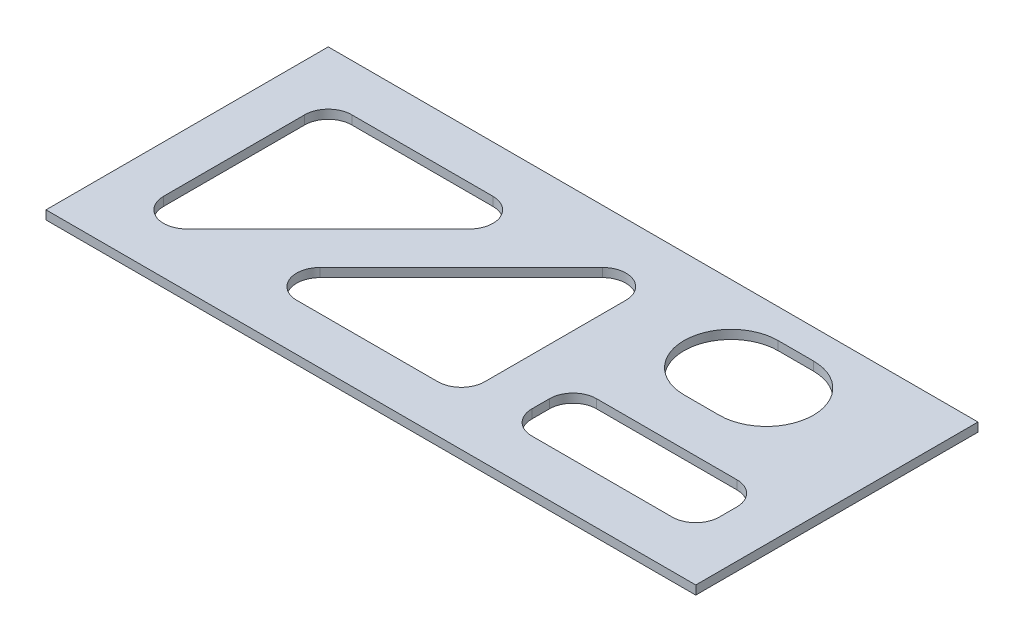
ISO-10303-21;
HEADER;
FILE_DESCRIPTION(('STEP AP214'),'2;1');
FILE_NAME('part.step','',(''),(''),'','','');
FILE_SCHEMA(('AUTOMOTIVE_DESIGN { 1 0 10303 214 1 1 1 1 }'));
ENDSEC;
DATA;
#1=APPLICATION_CONTEXT('core data for automotive mechanical design processes');
#2=APPLICATION_PROTOCOL_DEFINITION('international standard','automotive_design',2000,#1);
#3=PRODUCT_CONTEXT('',#1,'mechanical');
#4=PRODUCT('Part','Part','',(#3));
#5=PRODUCT_RELATED_PRODUCT_CATEGORY('part','',(#4));
#6=PRODUCT_DEFINITION_FORMATION('','',#4);
#7=PRODUCT_DEFINITION_CONTEXT('part definition',#1,'design');
#8=PRODUCT_DEFINITION('design','',#6,#7);
#9=PRODUCT_DEFINITION_SHAPE('','',#8);
#10=(LENGTH_UNIT() NAMED_UNIT(*) SI_UNIT(.MILLI.,.METRE.));
#11=(NAMED_UNIT(*) PLANE_ANGLE_UNIT() SI_UNIT($,.RADIAN.));
#12=(NAMED_UNIT(*) SI_UNIT($,.STERADIAN.) SOLID_ANGLE_UNIT());
#13=UNCERTAINTY_MEASURE_WITH_UNIT(LENGTH_MEASURE(1.E-05),#10,'distance_accuracy_value','');
#14=(GEOMETRIC_REPRESENTATION_CONTEXT(3) GLOBAL_UNCERTAINTY_ASSIGNED_CONTEXT((#13)) GLOBAL_UNIT_ASSIGNED_CONTEXT((#10,
#11,#12)) REPRESENTATION_CONTEXT('',''));
#15=CARTESIAN_POINT('',(0.,0.,0.));
#16=DIRECTION('',(0.,0.,1.));
#17=DIRECTION('',(1.,0.,0.));
#18=AXIS2_PLACEMENT_3D('',#15,#16,#17);
#19=CARTESIAN_POINT('',(-175.41875,2.38125,-76.2));
#20=DIRECTION('',(1.,0.,0.));
#21=DIRECTION('',(0.,0.,-1.));
#22=AXIS2_PLACEMENT_3D('',#19,#20,#21);
#23=PLANE('',#22);
#24=DIRECTION('',(0.,0.,1.));
#25=VECTOR('',#24,1.);
#26=CARTESIAN_POINT('',(-175.41875,-2.38125,-76.2));
#27=LINE('',#26,#25);
#28=CARTESIAN_POINT('',(-175.41875,-2.38125,-76.2));
#29=VERTEX_POINT('',#28);
#30=CARTESIAN_POINT('',(-175.41875,-2.38125,76.2));
#31=VERTEX_POINT('',#30);
#32=EDGE_CURVE('E506',#29,#31,#27,.T.);
#33=ORIENTED_EDGE('',*,*,#32,.T.);
#34=DIRECTION('',(0.,-1.,0.));
#35=VECTOR('',#34,1.);
#36=CARTESIAN_POINT('',(-175.41875,2.38125,76.2));
#37=LINE('',#36,#35);
#38=CARTESIAN_POINT('',(-175.41875,2.38125,76.2));
#39=VERTEX_POINT('',#38);
#40=EDGE_CURVE('E11',#39,#31,#37,.T.);
#41=ORIENTED_EDGE('',*,*,#40,.F.);
#42=DIRECTION('',(0.,0.,1.));
#43=VECTOR('',#42,1.);
#44=CARTESIAN_POINT('',(-175.41875,2.38125,-76.2));
#45=LINE('',#44,#43);
#46=CARTESIAN_POINT('',(-175.41875,2.38125,-76.2));
#47=VERTEX_POINT('',#46);
#48=EDGE_CURVE('E515',#47,#39,#45,.T.);
#49=ORIENTED_EDGE('',*,*,#48,.F.);
#50=DIRECTION('',(0.,-1.,0.));
#51=VECTOR('',#50,1.);
#52=CARTESIAN_POINT('',(-175.41875,2.38125,-76.2));
#53=LINE('',#52,#51);
#54=EDGE_CURVE('E529',#47,#29,#53,.T.);
#55=ORIENTED_EDGE('',*,*,#54,.T.);
#56=EDGE_LOOP('',(#33,#41,#49,#55));
#57=FACE_BOUND('',#56,.T.);
#58=ADVANCED_FACE('F38',(#57),#23,.F.);
#59=CARTESIAN_POINT('',(175.41875,2.38125,76.2));
#60=DIRECTION('',(0.,0.,-1.));
#61=DIRECTION('',(-1.,0.,0.));
#62=AXIS2_PLACEMENT_3D('',#59,#60,#61);
#63=PLANE('',#62);
#64=DIRECTION('',(1.,0.,0.));
#65=VECTOR('',#64,1.);
#66=CARTESIAN_POINT('',(175.41875,-2.38125,76.2));
#67=LINE('',#66,#65);
#68=CARTESIAN_POINT('',(175.41875,-2.38125,76.2));
#69=VERTEX_POINT('',#68);
#70=EDGE_CURVE('E533',#31,#69,#67,.T.);
#71=ORIENTED_EDGE('',*,*,#70,.T.);
#72=DIRECTION('',(0.,-1.,0.));
#73=VECTOR('',#72,1.);
#74=CARTESIAN_POINT('',(175.41875,2.38125,76.2));
#75=LINE('',#74,#73);
#76=CARTESIAN_POINT('',(175.41875,2.38125,76.2));
#77=VERTEX_POINT('',#76);
#78=EDGE_CURVE('E46',#77,#69,#75,.T.);
#79=ORIENTED_EDGE('',*,*,#78,.F.);
#80=DIRECTION('',(1.,0.,0.));
#81=VECTOR('',#80,1.);
#82=CARTESIAN_POINT('',(175.41875,2.38125,76.2));
#83=LINE('',#82,#81);
#84=EDGE_CURVE('E519',#39,#77,#83,.T.);
#85=ORIENTED_EDGE('',*,*,#84,.F.);
#86=ORIENTED_EDGE('',*,*,#40,.T.);
#87=EDGE_LOOP('',(#71,#79,#85,#86));
#88=FACE_BOUND('',#87,.T.);
#89=ADVANCED_FACE('F566',(#88),#63,.F.);
#90=CARTESIAN_POINT('',(175.41875,2.38125,-76.2));
#91=DIRECTION('',(-1.,0.,0.));
#92=DIRECTION('',(0.,0.,1.));
#93=AXIS2_PLACEMENT_3D('',#90,#91,#92);
#94=PLANE('',#93);
#95=DIRECTION('',(0.,0.,-1.));
#96=VECTOR('',#95,1.);
#97=CARTESIAN_POINT('',(175.41875,-2.38125,-76.2));
#98=LINE('',#97,#96);
#99=CARTESIAN_POINT('',(175.41875,-2.38125,-76.2));
#100=VERTEX_POINT('',#99);
#101=EDGE_CURVE('E536',#69,#100,#98,.T.);
#102=ORIENTED_EDGE('',*,*,#101,.T.);
#103=DIRECTION('',(0.,-1.,0.));
#104=VECTOR('',#103,1.);
#105=CARTESIAN_POINT('',(175.41875,2.38125,-76.2));
#106=LINE('',#105,#104);
#107=CARTESIAN_POINT('',(175.41875,2.38125,-76.2));
#108=VERTEX_POINT('',#107);
#109=EDGE_CURVE('E544',#108,#100,#106,.T.);
#110=ORIENTED_EDGE('',*,*,#109,.F.);
#111=DIRECTION('',(0.,0.,-1.));
#112=VECTOR('',#111,1.);
#113=CARTESIAN_POINT('',(175.41875,2.38125,-76.2));
#114=LINE('',#113,#112);
#115=EDGE_CURVE('E523',#77,#108,#114,.T.);
#116=ORIENTED_EDGE('',*,*,#115,.F.);
#117=ORIENTED_EDGE('',*,*,#78,.T.);
#118=EDGE_LOOP('',(#102,#110,#116,#117));
#119=FACE_BOUND('',#118,.T.);
#120=ADVANCED_FACE('F551',(#119),#94,.F.);
#121=CARTESIAN_POINT('',(175.41875,2.38125,-76.2));
#122=DIRECTION('',(0.,0.,1.));
#123=DIRECTION('',(1.,0.,0.));
#124=AXIS2_PLACEMENT_3D('',#121,#122,#123);
#125=PLANE('',#124);
#126=DIRECTION('',(-1.,0.,0.));
#127=VECTOR('',#126,1.);
#128=CARTESIAN_POINT('',(175.41875,-2.38125,-76.2));
#129=LINE('',#128,#127);
#130=EDGE_CURVE('E520',#100,#29,#129,.T.);
#131=ORIENTED_EDGE('',*,*,#130,.T.);
#132=ORIENTED_EDGE('',*,*,#54,.F.);
#133=DIRECTION('',(-1.,0.,0.));
#134=VECTOR('',#133,1.);
#135=CARTESIAN_POINT('',(175.41875,2.38125,-76.2));
#136=LINE('',#135,#134);
#137=EDGE_CURVE('E526',#108,#47,#136,.T.);
#138=ORIENTED_EDGE('',*,*,#137,.F.);
#139=ORIENTED_EDGE('',*,*,#109,.T.);
#140=EDGE_LOOP('',(#131,#132,#138,#139));
#141=FACE_BOUND('',#140,.T.);
#142=ADVANCED_FACE('F559',(#141),#125,.F.);
#143=CARTESIAN_POINT('',(-175.41875,2.38125,76.2));
#144=DIRECTION('',(0.,-1.,0.));
#145=DIRECTION('',(0.,0.,-1.));
#146=AXIS2_PLACEMENT_3D('',#143,#144,#145);
#147=PLANE('',#146);
#148=DIRECTION('',(1.,0.,0.));
#149=VECTOR('',#148,1.);
#150=CARTESIAN_POINT('',(61.523298968552,2.38125,50.8));
#151=LINE('',#150,#149);
#152=CARTESIAN_POINT('',(61.523298968552,2.38125,50.8));
#153=VERTEX_POINT('',#152);
#154=CARTESIAN_POINT('',(137.31875,2.38125,50.8));
#155=VERTEX_POINT('',#154);
#156=EDGE_CURVE('E308',#153,#155,#151,.T.);
#157=ORIENTED_EDGE('',*,*,#156,.F.);
#158=CARTESIAN_POINT('',(61.523298968552,2.38125,38.1));
#159=DIRECTION('',(0.,1.,0.));
#160=DIRECTION('',(0.,0.,1.));
#161=AXIS2_PLACEMENT_3D('',#158,#159,#160);
#162=CIRCLE('',#161,12.7);
#163=CARTESIAN_POINT('',(48.823298968552,2.38125,38.1));
#164=VERTEX_POINT('',#163);
#165=EDGE_CURVE('E56',#164,#153,#162,.T.);
#166=ORIENTED_EDGE('',*,*,#165,.F.);
#167=DIRECTION('',(0.,0.,1.));
#168=VECTOR('',#167,1.);
#169=CARTESIAN_POINT('',(48.8232989685521,2.38125,28.5749999999999));
#170=LINE('',#169,#168);
#171=CARTESIAN_POINT('',(48.8232989685521,2.38125,28.5749999999999));
#172=VERTEX_POINT('',#171);
#173=EDGE_CURVE('E283',#172,#164,#170,.T.);
#174=ORIENTED_EDGE('',*,*,#173,.F.);
#175=CARTESIAN_POINT('',(61.5232989685521,2.38125,28.5749999999999));
#176=DIRECTION('',(0.,1.,0.));
#177=DIRECTION('',(0.,0.,1.));
#178=AXIS2_PLACEMENT_3D('',#175,#176,#177);
#179=CIRCLE('',#178,12.7);
#180=CARTESIAN_POINT('',(61.5232989685521,2.38125,15.8749999999999));
#181=VERTEX_POINT('',#180);
#182=EDGE_CURVE('E288',#181,#172,#179,.T.);
#183=ORIENTED_EDGE('',*,*,#182,.F.);
#184=DIRECTION('',(-1.,0.,0.));
#185=VECTOR('',#184,1.);
#186=CARTESIAN_POINT('',(137.31875,2.38125,15.8749999999999));
#187=LINE('',#186,#185);
#188=CARTESIAN_POINT('',(137.31875,2.38125,15.875));
#189=VERTEX_POINT('',#188);
#190=EDGE_CURVE('E320',#189,#181,#187,.T.);
#191=ORIENTED_EDGE('',*,*,#190,.F.);
#192=CARTESIAN_POINT('',(137.31875,2.38125,28.5749999999999));
#193=DIRECTION('',(0.,1.,0.));
#194=DIRECTION('',(0.,0.,1.));
#195=AXIS2_PLACEMENT_3D('',#192,#193,#194);
#196=CIRCLE('',#195,12.7);
#197=CARTESIAN_POINT('',(150.01875,2.38125,28.5749999999999));
#198=VERTEX_POINT('',#197);
#199=EDGE_CURVE('E317',#198,#189,#196,.T.);
#200=ORIENTED_EDGE('',*,*,#199,.F.);
#201=DIRECTION('',(0.,0.,-1.));
#202=VECTOR('',#201,1.);
#203=CARTESIAN_POINT('',(150.01875,2.38125,38.1));
#204=LINE('',#203,#202);
#205=CARTESIAN_POINT('',(150.01875,2.38125,38.1));
#206=VERTEX_POINT('',#205);
#207=EDGE_CURVE('E314',#206,#198,#204,.T.);
#208=ORIENTED_EDGE('',*,*,#207,.F.);
#209=CARTESIAN_POINT('',(137.31875,2.38125,38.1));
#210=DIRECTION('',(0.,1.,0.));
#211=DIRECTION('',(0.,0.,1.));
#212=AXIS2_PLACEMENT_3D('',#209,#210,#211);
#213=CIRCLE('',#212,12.7);
#214=EDGE_CURVE('E311',#155,#206,#213,.T.);
#215=ORIENTED_EDGE('',*,*,#214,.F.);
#216=EDGE_LOOP('',(#157,#166,#174,#183,#191,#200,#208,#215));
#217=FACE_BOUND('',#216,.T.);
#218=DIRECTION('',(0.,0.,-1.));
#219=VECTOR('',#218,1.);
#220=CARTESIAN_POINT('',(23.4232989685521,2.38125,38.1));
#221=LINE('',#220,#219);
#222=CARTESIAN_POINT('',(23.4232989685521,2.38125,38.1));
#223=VERTEX_POINT('',#222);
#224=CARTESIAN_POINT('',(23.4232989685521,2.38125,-38.1000000000001));
#225=VERTEX_POINT('',#224);
#226=EDGE_CURVE('E372',#223,#225,#221,.T.);
#227=ORIENTED_EDGE('',*,*,#226,.F.);
#228=CARTESIAN_POINT('',(10.7232989685521,2.38125,38.1));
#229=DIRECTION('',(0.,1.,0.));
#230=DIRECTION('',(0.,0.,1.));
#231=AXIS2_PLACEMENT_3D('',#228,#229,#230);
#232=CIRCLE('',#231,12.7);
#233=CARTESIAN_POINT('',(10.7232989685521,2.38125,50.8));
#234=VERTEX_POINT('',#233);
#235=EDGE_CURVE('E330',#234,#223,#232,.T.);
#236=ORIENTED_EDGE('',*,*,#235,.F.);
#237=DIRECTION('',(1.,0.,0.));
#238=VECTOR('',#237,1.);
#239=CARTESIAN_POINT('',(-65.4767010314471,2.38125,50.8));
#240=LINE('',#239,#238);
#241=CARTESIAN_POINT('',(-65.4767010314471,2.38125,50.8));
#242=VERTEX_POINT('',#241);
#243=EDGE_CURVE('E349',#242,#234,#240,.T.);
#244=ORIENTED_EDGE('',*,*,#243,.F.);
#245=CARTESIAN_POINT('',(-65.4767010314471,2.38125,38.1));
#246=DIRECTION('',(0.,1.,0.));
#247=DIRECTION('',(0.,0.,1.));
#248=AXIS2_PLACEMENT_3D('',#245,#246,#247);
#249=CIRCLE('',#248,12.7);
#250=CARTESIAN_POINT('',(-74.4569571525163,2.38125,29.1197438789309));
#251=VERTEX_POINT('',#250);
#252=EDGE_CURVE('E384',#251,#242,#249,.T.);
#253=ORIENTED_EDGE('',*,*,#252,.F.);
#254=DIRECTION('',(-0.707106781186544,0.,0.707106781186552));
#255=VECTOR('',#254,1.);
#256=CARTESIAN_POINT('',(1.74304284748289,2.38125,-47.0802561210692));
#257=LINE('',#256,#255);
#258=CARTESIAN_POINT('',(1.74304284748287,2.38125,-47.0802561210692));
#259=VERTEX_POINT('',#258);
#260=EDGE_CURVE('E380',#259,#251,#257,.T.);
#261=ORIENTED_EDGE('',*,*,#260,.F.);
#262=CARTESIAN_POINT('',(10.7232989685521,2.38125,-38.1000000000001));
#263=DIRECTION('',(0.,1.,0.));
#264=DIRECTION('',(0.,0.,1.));
#265=AXIS2_PLACEMENT_3D('',#262,#263,#264);
#266=CIRCLE('',#265,12.7);
#267=EDGE_CURVE('E376',#225,#259,#266,.T.);
#268=ORIENTED_EDGE('',*,*,#267,.F.);
#269=EDGE_LOOP('',(#227,#236,#244,#253,#261,#268));
#270=FACE_BOUND('',#269,.T.);
#271=DIRECTION('',(0.,0.,1.));
#272=VECTOR('',#271,1.);
#273=CARTESIAN_POINT('',(-150.01875,2.38125,38.1));
#274=LINE('',#273,#272);
#275=CARTESIAN_POINT('',(-150.01875,2.38125,-38.1000000000001));
#276=VERTEX_POINT('',#275);
#277=CARTESIAN_POINT('',(-150.01875,2.38125,38.1));
#278=VERTEX_POINT('',#277);
#279=EDGE_CURVE('E438',#276,#278,#274,.T.);
#280=ORIENTED_EDGE('',*,*,#279,.F.);
#281=CARTESIAN_POINT('',(-137.31875,2.38125,-38.1000000000001));
#282=DIRECTION('',(0.,1.,0.));
#283=DIRECTION('',(0.,0.,-1.));
#284=AXIS2_PLACEMENT_3D('',#281,#282,#283);
#285=CIRCLE('',#284,12.7);
#286=CARTESIAN_POINT('',(-137.31875,2.38125,-50.8));
#287=VERTEX_POINT('',#286);
#288=EDGE_CURVE('E394',#287,#276,#285,.T.);
#289=ORIENTED_EDGE('',*,*,#288,.F.);
#290=DIRECTION('',(-1.,0.,0.));
#291=VECTOR('',#290,1.);
#292=CARTESIAN_POINT('',(-137.31875,2.38125,-50.8));
#293=LINE('',#292,#291);
#294=CARTESIAN_POINT('',(-61.1187500000008,2.38125,-50.8));
#295=VERTEX_POINT('',#294);
#296=EDGE_CURVE('E415',#295,#287,#293,.T.);
#297=ORIENTED_EDGE('',*,*,#296,.F.);
#298=CARTESIAN_POINT('',(-61.1187500000008,2.38125,-38.1000000000001));
#299=DIRECTION('',(0.,1.,0.));
#300=DIRECTION('',(0.,0.,-1.));
#301=AXIS2_PLACEMENT_3D('',#298,#299,#300);
#302=CIRCLE('',#301,12.7);
#303=CARTESIAN_POINT('',(-52.1384938789315,2.38125,-29.119743878931));
#304=VERTEX_POINT('',#303);
#305=EDGE_CURVE('E450',#304,#295,#302,.T.);
#306=ORIENTED_EDGE('',*,*,#305,.F.);
#307=DIRECTION('',(0.707106781186544,0.,-0.707106781186551));
#308=VECTOR('',#307,1.);
#309=CARTESIAN_POINT('',(-52.1384938789315,2.38125,-29.1197438789309));
#310=LINE('',#309,#308);
#311=CARTESIAN_POINT('',(-128.338493878931,2.38125,47.0802561210691));
#312=VERTEX_POINT('',#311);
#313=EDGE_CURVE('E446',#312,#304,#310,.T.);
#314=ORIENTED_EDGE('',*,*,#313,.F.);
#315=CARTESIAN_POINT('',(-137.31875,2.38125,38.1));
#316=DIRECTION('',(0.,1.,0.));
#317=DIRECTION('',(0.,0.,-1.));
#318=AXIS2_PLACEMENT_3D('',#315,#316,#317);
#319=CIRCLE('',#318,12.7);
#320=EDGE_CURVE('E442',#278,#312,#319,.T.);
#321=ORIENTED_EDGE('',*,*,#320,.F.);
#322=EDGE_LOOP('',(#280,#289,#297,#306,#314,#321));
#323=FACE_BOUND('',#322,.T.);
#324=DIRECTION('',(-1.,0.,0.));
#325=VECTOR('',#324,1.);
#326=CARTESIAN_POINT('',(102.39375,2.38125,-60.325));
#327=LINE('',#326,#325);
#328=CARTESIAN_POINT('',(102.39375,2.38125,-60.3250000000001));
#329=VERTEX_POINT('',#328);
#330=CARTESIAN_POINT('',(83.34375,2.38125,-60.325));
#331=VERTEX_POINT('',#330);
#332=EDGE_CURVE('E494',#329,#331,#327,.T.);
#333=ORIENTED_EDGE('',*,*,#332,.F.);
#334=CARTESIAN_POINT('',(102.39375,2.38125,-34.9250000000001));
#335=DIRECTION('',(0.,1.,0.));
#336=DIRECTION('',(0.,0.,1.));
#337=AXIS2_PLACEMENT_3D('',#334,#335,#336);
#338=CIRCLE('',#337,25.4);
#339=CARTESIAN_POINT('',(102.39375,2.38125,-9.52500000000005));
#340=VERTEX_POINT('',#339);
#341=EDGE_CURVE('E460',#340,#329,#338,.T.);
#342=ORIENTED_EDGE('',*,*,#341,.F.);
#343=DIRECTION('',(1.,0.,0.));
#344=VECTOR('',#343,1.);
#345=CARTESIAN_POINT('',(102.39375,2.38125,-9.52500000000005));
#346=LINE('',#345,#344);
#347=CARTESIAN_POINT('',(83.34375,2.38125,-9.52500000000005));
#348=VERTEX_POINT('',#347);
#349=EDGE_CURVE('E480',#348,#340,#346,.T.);
#350=ORIENTED_EDGE('',*,*,#349,.F.);
#351=CARTESIAN_POINT('',(83.34375,2.38125,-34.925));
#352=DIRECTION('',(0.,1.,0.));
#353=DIRECTION('',(0.,0.,1.));
#354=AXIS2_PLACEMENT_3D('',#351,#352,#353);
#355=CIRCLE('',#354,25.4);
#356=EDGE_CURVE('E498',#331,#348,#355,.T.);
#357=ORIENTED_EDGE('',*,*,#356,.F.);
#358=EDGE_LOOP('',(#333,#342,#350,#357));
#359=FACE_BOUND('',#358,.T.);
#360=ORIENTED_EDGE('',*,*,#48,.T.);
#361=ORIENTED_EDGE('',*,*,#84,.T.);
#362=ORIENTED_EDGE('',*,*,#115,.T.);
#363=ORIENTED_EDGE('',*,*,#137,.T.);
#364=EDGE_LOOP('',(#360,#361,#362,#363));
#365=FACE_BOUND('',#364,.T.);
#366=ADVANCED_FACE('F565',(#217,#270,#323,#359,#365),#147,.F.);
#367=CARTESIAN_POINT('',(-175.41875,-2.38125,76.2));
#368=DIRECTION('',(0.,-1.,0.));
#369=DIRECTION('',(0.,0.,-1.));
#370=AXIS2_PLACEMENT_3D('',#367,#368,#369);
#371=PLANE('',#370);
#372=CARTESIAN_POINT('',(61.523298968552,-2.38125,38.1));
#373=DIRECTION('',(0.,1.,0.));
#374=DIRECTION('',(0.,0.,1.));
#375=AXIS2_PLACEMENT_3D('',#372,#373,#374);
#376=CIRCLE('',#375,12.7);
#377=CARTESIAN_POINT('',(48.823298968552,-2.38125,38.1));
#378=VERTEX_POINT('',#377);
#379=CARTESIAN_POINT('',(61.523298968552,-2.38125,50.8));
#380=VERTEX_POINT('',#379);
#381=EDGE_CURVE('E263',#378,#380,#376,.T.);
#382=ORIENTED_EDGE('',*,*,#381,.T.);
#383=DIRECTION('',(1.,0.,0.));
#384=VECTOR('',#383,1.);
#385=CARTESIAN_POINT('',(61.523298968552,-2.38125,50.8));
#386=LINE('',#385,#384);
#387=CARTESIAN_POINT('',(137.31875,-2.38125,50.8));
#388=VERTEX_POINT('',#387);
#389=EDGE_CURVE('E273',#380,#388,#386,.T.);
#390=ORIENTED_EDGE('',*,*,#389,.T.);
#391=CARTESIAN_POINT('',(137.31875,-2.38125,38.1));
#392=DIRECTION('',(0.,1.,0.));
#393=DIRECTION('',(0.,0.,1.));
#394=AXIS2_PLACEMENT_3D('',#391,#392,#393);
#395=CIRCLE('',#394,12.7);
#396=CARTESIAN_POINT('',(150.01875,-2.38125,38.1));
#397=VERTEX_POINT('',#396);
#398=EDGE_CURVE('E64',#388,#397,#395,.T.);
#399=ORIENTED_EDGE('',*,*,#398,.T.);
#400=DIRECTION('',(0.,0.,-1.));
#401=VECTOR('',#400,1.);
#402=CARTESIAN_POINT('',(150.01875,-2.38125,38.1));
#403=LINE('',#402,#401);
#404=CARTESIAN_POINT('',(150.01875,-2.38125,28.5749999999999));
#405=VERTEX_POINT('',#404);
#406=EDGE_CURVE('E292',#397,#405,#403,.T.);
#407=ORIENTED_EDGE('',*,*,#406,.T.);
#408=CARTESIAN_POINT('',(137.31875,-2.38125,28.5749999999999));
#409=DIRECTION('',(0.,1.,0.));
#410=DIRECTION('',(0.,0.,1.));
#411=AXIS2_PLACEMENT_3D('',#408,#409,#410);
#412=CIRCLE('',#411,12.7);
#413=CARTESIAN_POINT('',(137.31875,-2.38125,15.875));
#414=VERTEX_POINT('',#413);
#415=EDGE_CURVE('E295',#405,#414,#412,.T.);
#416=ORIENTED_EDGE('',*,*,#415,.T.);
#417=DIRECTION('',(-1.,0.,0.));
#418=VECTOR('',#417,1.);
#419=CARTESIAN_POINT('',(137.31875,-2.38125,15.8749999999999));
#420=LINE('',#419,#418);
#421=CARTESIAN_POINT('',(61.5232989685521,-2.38125,15.8749999999999));
#422=VERTEX_POINT('',#421);
#423=EDGE_CURVE('E298',#414,#422,#420,.T.);
#424=ORIENTED_EDGE('',*,*,#423,.T.);
#425=CARTESIAN_POINT('',(61.5232989685521,-2.38125,28.5749999999999));
#426=DIRECTION('',(0.,1.,0.));
#427=DIRECTION('',(0.,0.,1.));
#428=AXIS2_PLACEMENT_3D('',#425,#426,#427);
#429=CIRCLE('',#428,12.7);
#430=CARTESIAN_POINT('',(48.8232989685521,-2.38125,28.5749999999999));
#431=VERTEX_POINT('',#430);
#432=EDGE_CURVE('E302',#422,#431,#429,.T.);
#433=ORIENTED_EDGE('',*,*,#432,.T.);
#434=DIRECTION('',(0.,0.,1.));
#435=VECTOR('',#434,1.);
#436=CARTESIAN_POINT('',(48.8232989685521,-2.38125,28.5749999999999));
#437=LINE('',#436,#435);
#438=EDGE_CURVE('E270',#431,#378,#437,.T.);
#439=ORIENTED_EDGE('',*,*,#438,.T.);
#440=EDGE_LOOP('',(#382,#390,#399,#407,#416,#424,#433,#439));
#441=FACE_BOUND('',#440,.T.);
#442=CARTESIAN_POINT('',(10.7232989685521,-2.38125,38.1));
#443=DIRECTION('',(0.,1.,0.));
#444=DIRECTION('',(0.,0.,1.));
#445=AXIS2_PLACEMENT_3D('',#442,#443,#444);
#446=CIRCLE('',#445,12.7);
#447=CARTESIAN_POINT('',(10.7232989685521,-2.38125,50.8));
#448=VERTEX_POINT('',#447);
#449=CARTESIAN_POINT('',(23.4232989685521,-2.38125,38.1));
#450=VERTEX_POINT('',#449);
#451=EDGE_CURVE('E344',#448,#450,#446,.T.);
#452=ORIENTED_EDGE('',*,*,#451,.T.);
#453=DIRECTION('',(0.,0.,-1.));
#454=VECTOR('',#453,1.);
#455=CARTESIAN_POINT('',(23.4232989685521,-2.38125,38.1));
#456=LINE('',#455,#454);
#457=CARTESIAN_POINT('',(23.4232989685521,-2.38125,-38.1000000000001));
#458=VERTEX_POINT('',#457);
#459=EDGE_CURVE('E348',#450,#458,#456,.T.);
#460=ORIENTED_EDGE('',*,*,#459,.T.);
#461=CARTESIAN_POINT('',(10.7232989685521,-2.38125,-38.1000000000001));
#462=DIRECTION('',(0.,1.,0.));
#463=DIRECTION('',(0.,0.,1.));
#464=AXIS2_PLACEMENT_3D('',#461,#462,#463);
#465=CIRCLE('',#464,12.7);
#466=CARTESIAN_POINT('',(1.74304284748287,-2.38125,-47.0802561210692));
#467=VERTEX_POINT('',#466);
#468=EDGE_CURVE('E353',#458,#467,#465,.T.);
#469=ORIENTED_EDGE('',*,*,#468,.T.);
#470=DIRECTION('',(-0.707106781186544,0.,0.707106781186552));
#471=VECTOR('',#470,1.);
#472=CARTESIAN_POINT('',(1.74304284748289,-2.38125,-47.0802561210692));
#473=LINE('',#472,#471);
#474=CARTESIAN_POINT('',(-74.4569571525163,-2.38125,29.1197438789309));
#475=VERTEX_POINT('',#474);
#476=EDGE_CURVE('E357',#467,#475,#473,.T.);
#477=ORIENTED_EDGE('',*,*,#476,.T.);
#478=CARTESIAN_POINT('',(-65.4767010314471,-2.38125,38.1));
#479=DIRECTION('',(0.,1.,0.));
#480=DIRECTION('',(0.,0.,1.));
#481=AXIS2_PLACEMENT_3D('',#478,#479,#480);
#482=CIRCLE('',#481,12.7);
#483=CARTESIAN_POINT('',(-65.4767010314471,-2.38125,50.8));
#484=VERTEX_POINT('',#483);
#485=EDGE_CURVE('E361',#475,#484,#482,.T.);
#486=ORIENTED_EDGE('',*,*,#485,.T.);
#487=DIRECTION('',(1.,0.,0.));
#488=VECTOR('',#487,1.);
#489=CARTESIAN_POINT('',(-65.4767010314471,-2.38125,50.8));
#490=LINE('',#489,#488);
#491=EDGE_CURVE('E365',#484,#448,#490,.T.);
#492=ORIENTED_EDGE('',*,*,#491,.T.);
#493=EDGE_LOOP('',(#452,#460,#469,#477,#486,#492));
#494=FACE_BOUND('',#493,.T.);
#495=CARTESIAN_POINT('',(-137.31875,-2.38125,-38.1000000000001));
#496=DIRECTION('',(0.,1.,0.));
#497=DIRECTION('',(0.,0.,-1.));
#498=AXIS2_PLACEMENT_3D('',#495,#496,#497);
#499=CIRCLE('',#498,12.7);
#500=CARTESIAN_POINT('',(-137.31875,-2.38125,-50.8));
#501=VERTEX_POINT('',#500);
#502=CARTESIAN_POINT('',(-150.01875,-2.38125,-38.1000000000001));
#503=VERTEX_POINT('',#502);
#504=EDGE_CURVE('E410',#501,#503,#499,.T.);
#505=ORIENTED_EDGE('',*,*,#504,.T.);
#506=DIRECTION('',(0.,0.,1.));
#507=VECTOR('',#506,1.);
#508=CARTESIAN_POINT('',(-150.01875,-2.38125,38.1));
#509=LINE('',#508,#507);
#510=CARTESIAN_POINT('',(-150.01875,-2.38125,38.1));
#511=VERTEX_POINT('',#510);
#512=EDGE_CURVE('E414',#503,#511,#509,.T.);
#513=ORIENTED_EDGE('',*,*,#512,.T.);
#514=CARTESIAN_POINT('',(-137.31875,-2.38125,38.1));
#515=DIRECTION('',(0.,1.,0.));
#516=DIRECTION('',(0.,0.,-1.));
#517=AXIS2_PLACEMENT_3D('',#514,#515,#516);
#518=CIRCLE('',#517,12.7);
#519=CARTESIAN_POINT('',(-128.338493878931,-2.38125,47.0802561210691));
#520=VERTEX_POINT('',#519);
#521=EDGE_CURVE('E419',#511,#520,#518,.T.);
#522=ORIENTED_EDGE('',*,*,#521,.T.);
#523=DIRECTION('',(0.707106781186544,0.,-0.707106781186551));
#524=VECTOR('',#523,1.);
#525=CARTESIAN_POINT('',(-52.1384938789315,-2.38125,-29.1197438789309));
#526=LINE('',#525,#524);
#527=CARTESIAN_POINT('',(-52.1384938789315,-2.38125,-29.119743878931));
#528=VERTEX_POINT('',#527);
#529=EDGE_CURVE('E423',#520,#528,#526,.T.);
#530=ORIENTED_EDGE('',*,*,#529,.T.);
#531=CARTESIAN_POINT('',(-61.1187500000008,-2.38125,-38.1000000000001));
#532=DIRECTION('',(0.,1.,0.));
#533=DIRECTION('',(0.,0.,-1.));
#534=AXIS2_PLACEMENT_3D('',#531,#532,#533);
#535=CIRCLE('',#534,12.7);
#536=CARTESIAN_POINT('',(-61.1187500000008,-2.38125,-50.8));
#537=VERTEX_POINT('',#536);
#538=EDGE_CURVE('E427',#528,#537,#535,.T.);
#539=ORIENTED_EDGE('',*,*,#538,.T.);
#540=DIRECTION('',(-1.,0.,0.));
#541=VECTOR('',#540,1.);
#542=CARTESIAN_POINT('',(-137.31875,-2.38125,-50.8));
#543=LINE('',#542,#541);
#544=EDGE_CURVE('E431',#537,#501,#543,.T.);
#545=ORIENTED_EDGE('',*,*,#544,.T.);
#546=EDGE_LOOP('',(#505,#513,#522,#530,#539,#545));
#547=FACE_BOUND('',#546,.T.);
#548=CARTESIAN_POINT('',(102.39375,-2.38125,-34.9250000000001));
#549=DIRECTION('',(0.,1.,0.));
#550=DIRECTION('',(0.,0.,1.));
#551=AXIS2_PLACEMENT_3D('',#548,#549,#550);
#552=CIRCLE('',#551,25.4);
#553=CARTESIAN_POINT('',(102.39375,-2.38125,-9.52500000000005));
#554=VERTEX_POINT('',#553);
#555=CARTESIAN_POINT('',(102.39375,-2.38125,-60.325));
#556=VERTEX_POINT('',#555);
#557=EDGE_CURVE('E475',#554,#556,#552,.T.);
#558=ORIENTED_EDGE('',*,*,#557,.T.);
#559=DIRECTION('',(-1.,0.,0.));
#560=VECTOR('',#559,1.);
#561=CARTESIAN_POINT('',(102.39375,-2.38125,-60.325));
#562=LINE('',#561,#560);
#563=CARTESIAN_POINT('',(83.34375,-2.38125,-60.325));
#564=VERTEX_POINT('',#563);
#565=EDGE_CURVE('E479',#556,#564,#562,.T.);
#566=ORIENTED_EDGE('',*,*,#565,.T.);
#567=CARTESIAN_POINT('',(83.34375,-2.38125,-34.925));
#568=DIRECTION('',(0.,1.,0.));
#569=DIRECTION('',(0.,0.,1.));
#570=AXIS2_PLACEMENT_3D('',#567,#568,#569);
#571=CIRCLE('',#570,25.4);
#572=CARTESIAN_POINT('',(83.34375,-2.38125,-9.52500000000005));
#573=VERTEX_POINT('',#572);
#574=EDGE_CURVE('E484',#564,#573,#571,.T.);
#575=ORIENTED_EDGE('',*,*,#574,.T.);
#576=DIRECTION('',(1.,0.,0.));
#577=VECTOR('',#576,1.);
#578=CARTESIAN_POINT('',(102.39375,-2.38125,-9.52500000000005));
#579=LINE('',#578,#577);
#580=EDGE_CURVE('E488',#573,#554,#579,.T.);
#581=ORIENTED_EDGE('',*,*,#580,.T.);
#582=EDGE_LOOP('',(#558,#566,#575,#581));
#583=FACE_BOUND('',#582,.T.);
#584=ORIENTED_EDGE('',*,*,#32,.F.);
#585=ORIENTED_EDGE('',*,*,#130,.F.);
#586=ORIENTED_EDGE('',*,*,#101,.F.);
#587=ORIENTED_EDGE('',*,*,#70,.F.);
#588=EDGE_LOOP('',(#584,#585,#586,#587));
#589=FACE_BOUND('',#588,.T.);
#590=ADVANCED_FACE('F278',(#441,#494,#547,#583,#589),#371,.T.);
#591=CARTESIAN_POINT('',(102.39375,-2.38125,-34.9250000000001));
#592=DIRECTION('',(0.,1.,0.));
#593=DIRECTION('',(0.,0.,1.));
#594=AXIS2_PLACEMENT_3D('',#591,#592,#593);
#595=CYLINDRICAL_SURFACE('',#594,25.4);
#596=ORIENTED_EDGE('',*,*,#341,.T.);
#597=DIRECTION('',(0.,1.,0.));
#598=VECTOR('',#597,1.);
#599=CARTESIAN_POINT('',(102.39375,-2.38125,-60.325));
#600=LINE('',#599,#598);
#601=EDGE_CURVE('E491',#556,#329,#600,.T.);
#602=ORIENTED_EDGE('',*,*,#601,.F.);
#603=ORIENTED_EDGE('',*,*,#557,.F.);
#604=DIRECTION('',(0.,1.,0.));
#605=VECTOR('',#604,1.);
#606=CARTESIAN_POINT('',(102.39375,-2.38125,-9.52500000000005));
#607=LINE('',#606,#605);
#608=EDGE_CURVE('E504',#554,#340,#607,.T.);
#609=ORIENTED_EDGE('',*,*,#608,.T.);
#610=EDGE_LOOP('',(#596,#602,#603,#609));
#611=FACE_BOUND('',#610,.T.);
#612=ADVANCED_FACE('F578',(#611),#595,.F.);
#613=CARTESIAN_POINT('',(102.39375,-2.38125,-9.52500000000005));
#614=DIRECTION('',(0.,0.,1.));
#615=DIRECTION('',(1.,0.,0.));
#616=AXIS2_PLACEMENT_3D('',#613,#614,#615);
#617=PLANE('',#616);
#618=ORIENTED_EDGE('',*,*,#349,.T.);
#619=ORIENTED_EDGE('',*,*,#608,.F.);
#620=ORIENTED_EDGE('',*,*,#580,.F.);
#621=DIRECTION('',(0.,1.,0.));
#622=VECTOR('',#621,1.);
#623=CARTESIAN_POINT('',(83.34375,-2.38125,-9.52500000000005));
#624=LINE('',#623,#622);
#625=EDGE_CURVE('E507',#573,#348,#624,.T.);
#626=ORIENTED_EDGE('',*,*,#625,.T.);
#627=EDGE_LOOP('',(#618,#619,#620,#626));
#628=FACE_BOUND('',#627,.T.);
#629=ADVANCED_FACE('F584',(#628),#617,.F.);
#630=CARTESIAN_POINT('',(83.34375,-2.38125,-34.925));
#631=DIRECTION('',(0.,1.,0.));
#632=DIRECTION('',(0.,0.,1.));
#633=AXIS2_PLACEMENT_3D('',#630,#631,#632);
#634=CYLINDRICAL_SURFACE('',#633,25.4);
#635=ORIENTED_EDGE('',*,*,#356,.T.);
#636=ORIENTED_EDGE('',*,*,#625,.F.);
#637=ORIENTED_EDGE('',*,*,#574,.F.);
#638=DIRECTION('',(0.,1.,0.));
#639=VECTOR('',#638,1.);
#640=CARTESIAN_POINT('',(83.34375,-2.38125,-60.325));
#641=LINE('',#640,#639);
#642=EDGE_CURVE('E509',#564,#331,#641,.T.);
#643=ORIENTED_EDGE('',*,*,#642,.T.);
#644=EDGE_LOOP('',(#635,#636,#637,#643));
#645=FACE_BOUND('',#644,.T.);
#646=ADVANCED_FACE('F590',(#645),#634,.F.);
#647=CARTESIAN_POINT('',(102.39375,-2.38125,-60.325));
#648=DIRECTION('',(0.,0.,-1.));
#649=DIRECTION('',(-1.,0.,0.));
#650=AXIS2_PLACEMENT_3D('',#647,#648,#649);
#651=PLANE('',#650);
#652=ORIENTED_EDGE('',*,*,#332,.T.);
#653=ORIENTED_EDGE('',*,*,#642,.F.);
#654=ORIENTED_EDGE('',*,*,#565,.F.);
#655=ORIENTED_EDGE('',*,*,#601,.T.);
#656=EDGE_LOOP('',(#652,#653,#654,#655));
#657=FACE_BOUND('',#656,.T.);
#658=ADVANCED_FACE('F586',(#657),#651,.F.);
#659=CARTESIAN_POINT('',(-137.31875,-2.38125,-38.1000000000001));
#660=DIRECTION('',(0.,1.,0.));
#661=DIRECTION('',(0.,0.,1.));
#662=AXIS2_PLACEMENT_3D('',#659,#660,#661);
#663=CYLINDRICAL_SURFACE('',#662,12.7);
#664=ORIENTED_EDGE('',*,*,#288,.T.);
#665=DIRECTION('',(0.,1.,0.));
#666=VECTOR('',#665,1.);
#667=CARTESIAN_POINT('',(-150.01875,-2.38125,-38.1000000000001));
#668=LINE('',#667,#666);
#669=EDGE_CURVE('E435',#503,#276,#668,.T.);
#670=ORIENTED_EDGE('',*,*,#669,.F.);
#671=ORIENTED_EDGE('',*,*,#504,.F.);
#672=DIRECTION('',(0.,1.,0.));
#673=VECTOR('',#672,1.);
#674=CARTESIAN_POINT('',(-137.31875,-2.38125,-50.8));
#675=LINE('',#674,#673);
#676=EDGE_CURVE('E457',#501,#287,#675,.T.);
#677=ORIENTED_EDGE('',*,*,#676,.T.);
#678=EDGE_LOOP('',(#664,#670,#671,#677));
#679=FACE_BOUND('',#678,.T.);
#680=ADVANCED_FACE('F589',(#679),#663,.F.);
#681=CARTESIAN_POINT('',(-137.31875,-2.38125,-50.8));
#682=DIRECTION('',(0.,0.,-1.));
#683=DIRECTION('',(-1.,0.,0.));
#684=AXIS2_PLACEMENT_3D('',#681,#682,#683);
#685=PLANE('',#684);
#686=ORIENTED_EDGE('',*,*,#296,.T.);
#687=ORIENTED_EDGE('',*,*,#676,.F.);
#688=ORIENTED_EDGE('',*,*,#544,.F.);
#689=DIRECTION('',(0.,1.,0.));
#690=VECTOR('',#689,1.);
#691=CARTESIAN_POINT('',(-61.1187500000008,-2.38125,-50.8));
#692=LINE('',#691,#690);
#693=EDGE_CURVE('E461',#537,#295,#692,.T.);
#694=ORIENTED_EDGE('',*,*,#693,.T.);
#695=EDGE_LOOP('',(#686,#687,#688,#694));
#696=FACE_BOUND('',#695,.T.);
#697=ADVANCED_FACE('F600',(#696),#685,.F.);
#698=CARTESIAN_POINT('',(-61.1187500000008,-2.38125,-38.1000000000001));
#699=DIRECTION('',(0.,1.,0.));
#700=DIRECTION('',(0.,0.,1.));
#701=AXIS2_PLACEMENT_3D('',#698,#699,#700);
#702=CYLINDRICAL_SURFACE('',#701,12.7);
#703=ORIENTED_EDGE('',*,*,#305,.T.);
#704=ORIENTED_EDGE('',*,*,#693,.F.);
#705=ORIENTED_EDGE('',*,*,#538,.F.);
#706=DIRECTION('',(0.,1.,0.));
#707=VECTOR('',#706,1.);
#708=CARTESIAN_POINT('',(-52.1384938789315,-2.38125,-29.119743878931));
#709=LINE('',#708,#707);
#710=EDGE_CURVE('E464',#528,#304,#709,.T.);
#711=ORIENTED_EDGE('',*,*,#710,.T.);
#712=EDGE_LOOP('',(#703,#704,#705,#711));
#713=FACE_BOUND('',#712,.T.);
#714=ADVANCED_FACE('F614',(#713),#702,.F.);
#715=CARTESIAN_POINT('',(-52.1384938789315,-2.38125,-29.1197438789309));
#716=DIRECTION('',(0.707106781186551,0.,0.707106781186544));
#717=DIRECTION('',(0.707106781186544,0.,-0.707106781186551));
#718=AXIS2_PLACEMENT_3D('',#715,#716,#717);
#719=PLANE('',#718);
#720=ORIENTED_EDGE('',*,*,#313,.T.);
#721=ORIENTED_EDGE('',*,*,#710,.F.);
#722=ORIENTED_EDGE('',*,*,#529,.F.);
#723=DIRECTION('',(0.,1.,0.));
#724=VECTOR('',#723,1.);
#725=CARTESIAN_POINT('',(-128.338493878931,-2.38125,47.0802561210691));
#726=LINE('',#725,#724);
#727=EDGE_CURVE('E467',#520,#312,#726,.T.);
#728=ORIENTED_EDGE('',*,*,#727,.T.);
#729=EDGE_LOOP('',(#720,#721,#722,#728));
#730=FACE_BOUND('',#729,.T.);
#731=ADVANCED_FACE('F610',(#730),#719,.F.);
#732=CARTESIAN_POINT('',(-137.31875,-2.38125,38.1));
#733=DIRECTION('',(0.,1.,0.));
#734=DIRECTION('',(0.,0.,1.));
#735=AXIS2_PLACEMENT_3D('',#732,#733,#734);
#736=CYLINDRICAL_SURFACE('',#735,12.7);
#737=ORIENTED_EDGE('',*,*,#320,.T.);
#738=ORIENTED_EDGE('',*,*,#727,.F.);
#739=ORIENTED_EDGE('',*,*,#521,.F.);
#740=DIRECTION('',(0.,1.,0.));
#741=VECTOR('',#740,1.);
#742=CARTESIAN_POINT('',(-150.01875,-2.38125,38.1));
#743=LINE('',#742,#741);
#744=EDGE_CURVE('E470',#511,#278,#743,.T.);
#745=ORIENTED_EDGE('',*,*,#744,.T.);
#746=EDGE_LOOP('',(#737,#738,#739,#745));
#747=FACE_BOUND('',#746,.T.);
#748=ADVANCED_FACE('F606',(#747),#736,.F.);
#749=CARTESIAN_POINT('',(-150.01875,-2.38125,38.1));
#750=DIRECTION('',(-1.,0.,0.));
#751=DIRECTION('',(0.,0.,1.));
#752=AXIS2_PLACEMENT_3D('',#749,#750,#751);
#753=PLANE('',#752);
#754=ORIENTED_EDGE('',*,*,#279,.T.);
#755=ORIENTED_EDGE('',*,*,#744,.F.);
#756=ORIENTED_EDGE('',*,*,#512,.F.);
#757=ORIENTED_EDGE('',*,*,#669,.T.);
#758=EDGE_LOOP('',(#754,#755,#756,#757));
#759=FACE_BOUND('',#758,.T.);
#760=ADVANCED_FACE('F602',(#759),#753,.F.);
#761=CARTESIAN_POINT('',(10.7232989685521,-2.38125,38.1));
#762=DIRECTION('',(0.,1.,0.));
#763=DIRECTION('',(0.,0.,1.));
#764=AXIS2_PLACEMENT_3D('',#761,#762,#763);
#765=CYLINDRICAL_SURFACE('',#764,12.7);
#766=ORIENTED_EDGE('',*,*,#235,.T.);
#767=DIRECTION('',(0.,1.,0.));
#768=VECTOR('',#767,1.);
#769=CARTESIAN_POINT('',(23.4232989685521,-2.38125,38.1));
#770=LINE('',#769,#768);
#771=EDGE_CURVE('E369',#450,#223,#770,.T.);
#772=ORIENTED_EDGE('',*,*,#771,.F.);
#773=ORIENTED_EDGE('',*,*,#451,.F.);
#774=DIRECTION('',(0.,1.,0.));
#775=VECTOR('',#774,1.);
#776=CARTESIAN_POINT('',(10.7232989685521,-2.38125,50.8));
#777=LINE('',#776,#775);
#778=EDGE_CURVE('E391',#448,#234,#777,.T.);
#779=ORIENTED_EDGE('',*,*,#778,.T.);
#780=EDGE_LOOP('',(#766,#772,#773,#779));
#781=FACE_BOUND('',#780,.T.);
#782=ADVANCED_FACE('F605',(#781),#765,.F.);
#783=CARTESIAN_POINT('',(-65.4767010314471,-2.38125,50.8));
#784=DIRECTION('',(0.,0.,1.));
#785=DIRECTION('',(1.,0.,0.));
#786=AXIS2_PLACEMENT_3D('',#783,#784,#785);
#787=PLANE('',#786);
#788=ORIENTED_EDGE('',*,*,#243,.T.);
#789=ORIENTED_EDGE('',*,*,#778,.F.);
#790=ORIENTED_EDGE('',*,*,#491,.F.);
#791=DIRECTION('',(0.,1.,0.));
#792=VECTOR('',#791,1.);
#793=CARTESIAN_POINT('',(-65.4767010314471,-2.38125,50.8));
#794=LINE('',#793,#792);
#795=EDGE_CURVE('E395',#484,#242,#794,.T.);
#796=ORIENTED_EDGE('',*,*,#795,.T.);
#797=EDGE_LOOP('',(#788,#789,#790,#796));
#798=FACE_BOUND('',#797,.T.);
#799=ADVANCED_FACE('F624',(#798),#787,.F.);
#800=CARTESIAN_POINT('',(-65.4767010314471,-2.38125,38.1));
#801=DIRECTION('',(0.,1.,0.));
#802=DIRECTION('',(0.,0.,1.));
#803=AXIS2_PLACEMENT_3D('',#800,#801,#802);
#804=CYLINDRICAL_SURFACE('',#803,12.7);
#805=ORIENTED_EDGE('',*,*,#252,.T.);
#806=ORIENTED_EDGE('',*,*,#795,.F.);
#807=ORIENTED_EDGE('',*,*,#485,.F.);
#808=DIRECTION('',(0.,1.,0.));
#809=VECTOR('',#808,1.);
#810=CARTESIAN_POINT('',(-74.4569571525163,-2.38125,29.1197438789309));
#811=LINE('',#810,#809);
#812=EDGE_CURVE('E398',#475,#251,#811,.T.);
#813=ORIENTED_EDGE('',*,*,#812,.T.);
#814=EDGE_LOOP('',(#805,#806,#807,#813));
#815=FACE_BOUND('',#814,.T.);
#816=ADVANCED_FACE('F637',(#815),#804,.F.);
#817=CARTESIAN_POINT('',(1.74304284748289,-2.38125,-47.0802561210692));
#818=DIRECTION('',(-0.707106781186551,0.,-0.707106781186544));
#819=DIRECTION('',(-0.707106781186544,0.,0.707106781186551));
#820=AXIS2_PLACEMENT_3D('',#817,#818,#819);
#821=PLANE('',#820);
#822=ORIENTED_EDGE('',*,*,#260,.T.);
#823=ORIENTED_EDGE('',*,*,#812,.F.);
#824=ORIENTED_EDGE('',*,*,#476,.F.);
#825=DIRECTION('',(0.,1.,0.));
#826=VECTOR('',#825,1.);
#827=CARTESIAN_POINT('',(1.74304284748287,-2.38125,-47.0802561210692));
#828=LINE('',#827,#826);
#829=EDGE_CURVE('E401',#467,#259,#828,.T.);
#830=ORIENTED_EDGE('',*,*,#829,.T.);
#831=EDGE_LOOP('',(#822,#823,#824,#830));
#832=FACE_BOUND('',#831,.T.);
#833=ADVANCED_FACE('F633',(#832),#821,.F.);
#834=CARTESIAN_POINT('',(10.7232989685521,-2.38125,-38.1000000000001));
#835=DIRECTION('',(0.,1.,0.));
#836=DIRECTION('',(0.,0.,1.));
#837=AXIS2_PLACEMENT_3D('',#834,#835,#836);
#838=CYLINDRICAL_SURFACE('',#837,12.7);
#839=ORIENTED_EDGE('',*,*,#267,.T.);
#840=ORIENTED_EDGE('',*,*,#829,.F.);
#841=ORIENTED_EDGE('',*,*,#468,.F.);
#842=DIRECTION('',(0.,1.,0.));
#843=VECTOR('',#842,1.);
#844=CARTESIAN_POINT('',(23.4232989685521,-2.38125,-38.1000000000001));
#845=LINE('',#844,#843);
#846=EDGE_CURVE('E404',#458,#225,#845,.T.);
#847=ORIENTED_EDGE('',*,*,#846,.T.);
#848=EDGE_LOOP('',(#839,#840,#841,#847));
#849=FACE_BOUND('',#848,.T.);
#850=ADVANCED_FACE('F629',(#849),#838,.F.);
#851=CARTESIAN_POINT('',(23.4232989685521,-2.38125,38.1));
#852=DIRECTION('',(1.,0.,0.));
#853=DIRECTION('',(0.,0.,-1.));
#854=AXIS2_PLACEMENT_3D('',#851,#852,#853);
#855=PLANE('',#854);
#856=ORIENTED_EDGE('',*,*,#226,.T.);
#857=ORIENTED_EDGE('',*,*,#846,.F.);
#858=ORIENTED_EDGE('',*,*,#459,.F.);
#859=ORIENTED_EDGE('',*,*,#771,.T.);
#860=EDGE_LOOP('',(#856,#857,#858,#859));
#861=FACE_BOUND('',#860,.T.);
#862=ADVANCED_FACE('F626',(#861),#855,.F.);
#863=CARTESIAN_POINT('',(61.523298968552,-2.38125,38.1));
#864=DIRECTION('',(0.,1.,0.));
#865=DIRECTION('',(0.,0.,1.));
#866=AXIS2_PLACEMENT_3D('',#863,#864,#865);
#867=CYLINDRICAL_SURFACE('',#866,12.7);
#868=ORIENTED_EDGE('',*,*,#165,.T.);
#869=DIRECTION('',(0.,1.,0.));
#870=VECTOR('',#869,1.);
#871=CARTESIAN_POINT('',(61.523298968552,-2.38125,50.8));
#872=LINE('',#871,#870);
#873=EDGE_CURVE('E259',#380,#153,#872,.T.);
#874=ORIENTED_EDGE('',*,*,#873,.F.);
#875=ORIENTED_EDGE('',*,*,#381,.F.);
#876=DIRECTION('',(0.,1.,0.));
#877=VECTOR('',#876,1.);
#878=CARTESIAN_POINT('',(48.823298968552,-2.38125,38.1));
#879=LINE('',#878,#877);
#880=EDGE_CURVE('E327',#378,#164,#879,.T.);
#881=ORIENTED_EDGE('',*,*,#880,.T.);
#882=EDGE_LOOP('',(#868,#874,#875,#881));
#883=FACE_BOUND('',#882,.T.);
#884=ADVANCED_FACE('F261',(#883),#867,.F.);
#885=CARTESIAN_POINT('',(48.8232989685521,-2.38125,28.5749999999999));
#886=DIRECTION('',(-1.,0.,0.));
#887=DIRECTION('',(0.,0.,1.));
#888=AXIS2_PLACEMENT_3D('',#885,#886,#887);
#889=PLANE('',#888);
#890=ORIENTED_EDGE('',*,*,#173,.T.);
#891=ORIENTED_EDGE('',*,*,#880,.F.);
#892=ORIENTED_EDGE('',*,*,#438,.F.);
#893=DIRECTION('',(0.,1.,0.));
#894=VECTOR('',#893,1.);
#895=CARTESIAN_POINT('',(48.8232989685521,-2.38125,28.5749999999999));
#896=LINE('',#895,#894);
#897=EDGE_CURVE('E331',#431,#172,#896,.T.);
#898=ORIENTED_EDGE('',*,*,#897,.T.);
#899=EDGE_LOOP('',(#890,#891,#892,#898));
#900=FACE_BOUND('',#899,.T.);
#901=ADVANCED_FACE('F647',(#900),#889,.F.);
#902=CARTESIAN_POINT('',(61.5232989685521,-2.38125,28.5749999999999));
#903=DIRECTION('',(0.,1.,0.));
#904=DIRECTION('',(0.,0.,1.));
#905=AXIS2_PLACEMENT_3D('',#902,#903,#904);
#906=CYLINDRICAL_SURFACE('',#905,12.7);
#907=ORIENTED_EDGE('',*,*,#182,.T.);
#908=ORIENTED_EDGE('',*,*,#897,.F.);
#909=ORIENTED_EDGE('',*,*,#432,.F.);
#910=DIRECTION('',(0.,1.,0.));
#911=VECTOR('',#910,1.);
#912=CARTESIAN_POINT('',(61.5232989685521,-2.38125,15.8749999999999));
#913=LINE('',#912,#911);
#914=EDGE_CURVE('E334',#422,#181,#913,.T.);
#915=ORIENTED_EDGE('',*,*,#914,.T.);
#916=EDGE_LOOP('',(#907,#908,#909,#915));
#917=FACE_BOUND('',#916,.T.);
#918=ADVANCED_FACE('F664',(#917),#906,.F.);
#919=CARTESIAN_POINT('',(137.31875,-2.38125,15.8749999999999));
#920=DIRECTION('',(0.,0.,-1.));
#921=DIRECTION('',(-1.,0.,0.));
#922=AXIS2_PLACEMENT_3D('',#919,#920,#921);
#923=PLANE('',#922);
#924=ORIENTED_EDGE('',*,*,#190,.T.);
#925=ORIENTED_EDGE('',*,*,#914,.F.);
#926=ORIENTED_EDGE('',*,*,#423,.F.);
#927=DIRECTION('',(0.,1.,0.));
#928=VECTOR('',#927,1.);
#929=CARTESIAN_POINT('',(137.31875,-2.38125,15.875));
#930=LINE('',#929,#928);
#931=EDGE_CURVE('E337',#414,#189,#930,.T.);
#932=ORIENTED_EDGE('',*,*,#931,.T.);
#933=EDGE_LOOP('',(#924,#925,#926,#932));
#934=FACE_BOUND('',#933,.T.);
#935=ADVANCED_FACE('F660',(#934),#923,.F.);
#936=CARTESIAN_POINT('',(137.31875,-2.38125,28.5749999999999));
#937=DIRECTION('',(0.,1.,0.));
#938=DIRECTION('',(0.,0.,1.));
#939=AXIS2_PLACEMENT_3D('',#936,#937,#938);
#940=CYLINDRICAL_SURFACE('',#939,12.7);
#941=ORIENTED_EDGE('',*,*,#199,.T.);
#942=ORIENTED_EDGE('',*,*,#931,.F.);
#943=ORIENTED_EDGE('',*,*,#415,.F.);
#944=DIRECTION('',(0.,1.,0.));
#945=VECTOR('',#944,1.);
#946=CARTESIAN_POINT('',(150.01875,-2.38125,28.5749999999999));
#947=LINE('',#946,#945);
#948=EDGE_CURVE('E339',#405,#198,#947,.T.);
#949=ORIENTED_EDGE('',*,*,#948,.T.);
#950=EDGE_LOOP('',(#941,#942,#943,#949));
#951=FACE_BOUND('',#950,.T.);
#952=ADVANCED_FACE('F656',(#951),#940,.F.);
#953=CARTESIAN_POINT('',(150.01875,-2.38125,38.1));
#954=DIRECTION('',(1.,0.,0.));
#955=DIRECTION('',(0.,0.,-1.));
#956=AXIS2_PLACEMENT_3D('',#953,#954,#955);
#957=PLANE('',#956);
#958=ORIENTED_EDGE('',*,*,#207,.T.);
#959=ORIENTED_EDGE('',*,*,#948,.F.);
#960=ORIENTED_EDGE('',*,*,#406,.F.);
#961=DIRECTION('',(0.,1.,0.));
#962=VECTOR('',#961,1.);
#963=CARTESIAN_POINT('',(150.01875,-2.38125,38.1));
#964=LINE('',#963,#962);
#965=EDGE_CURVE('E341',#397,#206,#964,.T.);
#966=ORIENTED_EDGE('',*,*,#965,.T.);
#967=EDGE_LOOP('',(#958,#959,#960,#966));
#968=FACE_BOUND('',#967,.T.);
#969=ADVANCED_FACE('F653',(#968),#957,.F.);
#970=CARTESIAN_POINT('',(137.31875,-2.38125,38.1));
#971=DIRECTION('',(0.,1.,0.));
#972=DIRECTION('',(0.,0.,1.));
#973=AXIS2_PLACEMENT_3D('',#970,#971,#972);
#974=CYLINDRICAL_SURFACE('',#973,12.7);
#975=ORIENTED_EDGE('',*,*,#214,.T.);
#976=ORIENTED_EDGE('',*,*,#965,.F.);
#977=ORIENTED_EDGE('',*,*,#398,.F.);
#978=DIRECTION('',(0.,1.,0.));
#979=VECTOR('',#978,1.);
#980=CARTESIAN_POINT('',(137.31875,-2.38125,50.8));
#981=LINE('',#980,#979);
#982=EDGE_CURVE('E269',#388,#155,#981,.T.);
#983=ORIENTED_EDGE('',*,*,#982,.T.);
#984=EDGE_LOOP('',(#975,#976,#977,#983));
#985=FACE_BOUND('',#984,.T.);
#986=ADVANCED_FACE('F650',(#985),#974,.F.);
#987=CARTESIAN_POINT('',(61.523298968552,-2.38125,50.8));
#988=DIRECTION('',(0.,0.,1.));
#989=DIRECTION('',(1.,0.,0.));
#990=AXIS2_PLACEMENT_3D('',#987,#988,#989);
#991=PLANE('',#990);
#992=ORIENTED_EDGE('',*,*,#156,.T.);
#993=ORIENTED_EDGE('',*,*,#982,.F.);
#994=ORIENTED_EDGE('',*,*,#389,.F.);
#995=ORIENTED_EDGE('',*,*,#873,.T.);
#996=EDGE_LOOP('',(#992,#993,#994,#995));
#997=FACE_BOUND('',#996,.T.);
#998=ADVANCED_FACE('F274',(#997),#991,.F.);
#999=CLOSED_SHELL('',(#58,#89,#120,#142,#366,#590,#612,#629,#646,#658,#680,#697,#714,#731,#748,
#760,#782,#799,#816,#833,#850,#862,#884,#901,#918,#935,#952,#969,#986,#998));
#1000=MANIFOLD_SOLID_BREP('B2',#999);
#1001=ADVANCED_BREP_SHAPE_REPRESENTATION('',(#18,#1000),#14);
#1002=SHAPE_DEFINITION_REPRESENTATION(#9,#1001);
ENDSEC;
END-ISO-10303-21;
